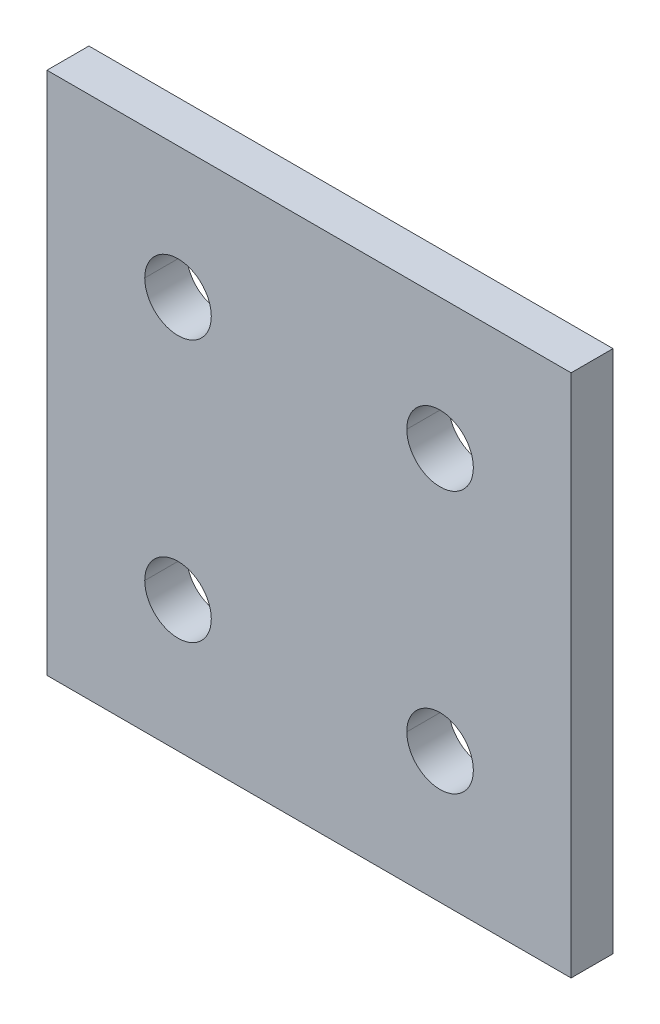
ISO-10303-21;
HEADER;
FILE_DESCRIPTION(('STEP AP214'),'2;1');
FILE_NAME('part.step','',(''),(''),'','','');
FILE_SCHEMA(('AUTOMOTIVE_DESIGN { 1 0 10303 214 1 1 1 1 }'));
ENDSEC;
DATA;
#1=APPLICATION_CONTEXT('core data for automotive mechanical design processes');
#2=APPLICATION_PROTOCOL_DEFINITION('international standard','automotive_design',2000,#1);
#3=PRODUCT_CONTEXT('',#1,'mechanical');
#4=PRODUCT('Part','Part','',(#3));
#5=PRODUCT_RELATED_PRODUCT_CATEGORY('part','',(#4));
#6=PRODUCT_DEFINITION_FORMATION('','',#4);
#7=PRODUCT_DEFINITION_CONTEXT('part definition',#1,'design');
#8=PRODUCT_DEFINITION('design','',#6,#7);
#9=PRODUCT_DEFINITION_SHAPE('','',#8);
#10=(LENGTH_UNIT() NAMED_UNIT(*) SI_UNIT(.MILLI.,.METRE.));
#11=(NAMED_UNIT(*) PLANE_ANGLE_UNIT() SI_UNIT($,.RADIAN.));
#12=(NAMED_UNIT(*) SI_UNIT($,.STERADIAN.) SOLID_ANGLE_UNIT());
#13=UNCERTAINTY_MEASURE_WITH_UNIT(LENGTH_MEASURE(1.E-05),#10,'distance_accuracy_value','');
#14=(GEOMETRIC_REPRESENTATION_CONTEXT(3) GLOBAL_UNCERTAINTY_ASSIGNED_CONTEXT((#13)) GLOBAL_UNIT_ASSIGNED_CONTEXT((#10,
#11,#12)) REPRESENTATION_CONTEXT('',''));
#15=CARTESIAN_POINT('',(0.,0.,0.));
#16=DIRECTION('',(0.,0.,1.));
#17=DIRECTION('',(1.,0.,0.));
#18=AXIS2_PLACEMENT_3D('',#15,#16,#17);
#19=CARTESIAN_POINT('',(25.,50.,4.));
#20=DIRECTION('',(0.,-1.,0.));
#21=DIRECTION('',(0.,0.,-1.));
#22=AXIS2_PLACEMENT_3D('',#19,#20,#21);
#23=PLANE('',#22);
#24=DIRECTION('',(-1.,0.,0.));
#25=VECTOR('',#24,1.);
#26=CARTESIAN_POINT('',(25.,50.,0.));
#27=LINE('',#26,#25);
#28=CARTESIAN_POINT('',(25.,50.,0.));
#29=VERTEX_POINT('',#28);
#30=CARTESIAN_POINT('',(-25.,50.,0.));
#31=VERTEX_POINT('',#30);
#32=EDGE_CURVE('E11',#29,#31,#27,.T.);
#33=ORIENTED_EDGE('',*,*,#32,.T.);
#34=DIRECTION('',(0.,0.,-1.));
#35=VECTOR('',#34,1.);
#36=CARTESIAN_POINT('',(-25.,50.,4.));
#37=LINE('',#36,#35);
#38=CARTESIAN_POINT('',(-25.,50.,4.));
#39=VERTEX_POINT('',#38);
#40=EDGE_CURVE('E24',#39,#31,#37,.T.);
#41=ORIENTED_EDGE('',*,*,#40,.F.);
#42=DIRECTION('',(-1.,0.,0.));
#43=VECTOR('',#42,1.);
#44=CARTESIAN_POINT('',(25.,50.,4.));
#45=LINE('',#44,#43);
#46=CARTESIAN_POINT('',(25.,50.,4.));
#47=VERTEX_POINT('',#46);
#48=EDGE_CURVE('E244',#47,#39,#45,.T.);
#49=ORIENTED_EDGE('',*,*,#48,.F.);
#50=DIRECTION('',(0.,0.,-1.));
#51=VECTOR('',#50,1.);
#52=CARTESIAN_POINT('',(25.,50.,4.));
#53=LINE('',#52,#51);
#54=EDGE_CURVE('E240',#47,#29,#53,.T.);
#55=ORIENTED_EDGE('',*,*,#54,.T.);
#56=EDGE_LOOP('',(#33,#41,#49,#55));
#57=FACE_BOUND('',#56,.T.);
#58=ADVANCED_FACE('F16',(#57),#23,.F.);
#59=CARTESIAN_POINT('',(25.,0.,4.));
#60=DIRECTION('',(-1.,0.,0.));
#61=DIRECTION('',(0.,0.,1.));
#62=AXIS2_PLACEMENT_3D('',#59,#60,#61);
#63=PLANE('',#62);
#64=DIRECTION('',(0.,1.,0.));
#65=VECTOR('',#64,1.);
#66=CARTESIAN_POINT('',(25.,0.,0.));
#67=LINE('',#66,#65);
#68=CARTESIAN_POINT('',(25.,0.,0.));
#69=VERTEX_POINT('',#68);
#70=EDGE_CURVE('E235',#69,#29,#67,.T.);
#71=ORIENTED_EDGE('',*,*,#70,.T.);
#72=ORIENTED_EDGE('',*,*,#54,.F.);
#73=DIRECTION('',(0.,1.,0.));
#74=VECTOR('',#73,1.);
#75=CARTESIAN_POINT('',(25.,0.,4.));
#76=LINE('',#75,#74);
#77=CARTESIAN_POINT('',(25.,0.,4.));
#78=VERTEX_POINT('',#77);
#79=EDGE_CURVE('E230',#78,#47,#76,.T.);
#80=ORIENTED_EDGE('',*,*,#79,.F.);
#81=DIRECTION('',(0.,0.,-1.));
#82=VECTOR('',#81,1.);
#83=CARTESIAN_POINT('',(25.,0.,4.));
#84=LINE('',#83,#82);
#85=EDGE_CURVE('E226',#78,#69,#84,.T.);
#86=ORIENTED_EDGE('',*,*,#85,.T.);
#87=EDGE_LOOP('',(#71,#72,#80,#86));
#88=FACE_BOUND('',#87,.T.);
#89=ADVANCED_FACE('F262',(#88),#63,.F.);
#90=CARTESIAN_POINT('',(-25.,0.,4.));
#91=DIRECTION('',(0.,1.,0.));
#92=DIRECTION('',(0.,0.,1.));
#93=AXIS2_PLACEMENT_3D('',#90,#91,#92);
#94=PLANE('',#93);
#95=DIRECTION('',(1.,0.,0.));
#96=VECTOR('',#95,1.);
#97=CARTESIAN_POINT('',(-25.,0.,0.));
#98=LINE('',#97,#96);
#99=CARTESIAN_POINT('',(-25.,0.,0.));
#100=VERTEX_POINT('',#99);
#101=EDGE_CURVE('E221',#100,#69,#98,.T.);
#102=ORIENTED_EDGE('',*,*,#101,.T.);
#103=ORIENTED_EDGE('',*,*,#85,.F.);
#104=DIRECTION('',(1.,0.,0.));
#105=VECTOR('',#104,1.);
#106=CARTESIAN_POINT('',(-25.,0.,4.));
#107=LINE('',#106,#105);
#108=CARTESIAN_POINT('',(-25.,0.,4.));
#109=VERTEX_POINT('',#108);
#110=EDGE_CURVE('E216',#109,#78,#107,.T.);
#111=ORIENTED_EDGE('',*,*,#110,.F.);
#112=DIRECTION('',(0.,0.,-1.));
#113=VECTOR('',#112,1.);
#114=CARTESIAN_POINT('',(-25.,0.,4.));
#115=LINE('',#114,#113);
#116=EDGE_CURVE('E212',#109,#100,#115,.T.);
#117=ORIENTED_EDGE('',*,*,#116,.T.);
#118=EDGE_LOOP('',(#102,#103,#111,#117));
#119=FACE_BOUND('',#118,.T.);
#120=ADVANCED_FACE('F266',(#119),#94,.F.);
#121=CARTESIAN_POINT('',(-25.,50.,4.));
#122=DIRECTION('',(1.,0.,0.));
#123=DIRECTION('',(0.,0.,-1.));
#124=AXIS2_PLACEMENT_3D('',#121,#122,#123);
#125=PLANE('',#124);
#126=DIRECTION('',(0.,-1.,0.));
#127=VECTOR('',#126,1.);
#128=CARTESIAN_POINT('',(-25.,50.,0.));
#129=LINE('',#128,#127);
#130=EDGE_CURVE('E207',#31,#100,#129,.T.);
#131=ORIENTED_EDGE('',*,*,#130,.T.);
#132=ORIENTED_EDGE('',*,*,#116,.F.);
#133=DIRECTION('',(0.,-1.,0.));
#134=VECTOR('',#133,1.);
#135=CARTESIAN_POINT('',(-25.,50.,4.));
#136=LINE('',#135,#134);
#137=EDGE_CURVE('E202',#39,#109,#136,.T.);
#138=ORIENTED_EDGE('',*,*,#137,.F.);
#139=ORIENTED_EDGE('',*,*,#40,.T.);
#140=EDGE_LOOP('',(#131,#132,#138,#139));
#141=FACE_BOUND('',#140,.T.);
#142=ADVANCED_FACE('F254',(#141),#125,.F.);
#143=CARTESIAN_POINT('',(0.,0.,4.));
#144=DIRECTION('',(0.,0.,1.));
#145=DIRECTION('',(1.,0.,0.));
#146=AXIS2_PLACEMENT_3D('',#143,#144,#145);
#147=PLANE('',#146);
#148=CARTESIAN_POINT('',(-12.5,37.5,4.));
#149=DIRECTION('',(0.,0.,1.));
#150=DIRECTION('',(1.,0.,0.));
#151=AXIS2_PLACEMENT_3D('',#148,#149,#150);
#152=CIRCLE('',#151,3.175);
#153=CARTESIAN_POINT('',(-15.675,37.5,4.));
#154=VERTEX_POINT('',#153);
#155=CARTESIAN_POINT('',(-9.325,37.5,4.));
#156=VERTEX_POINT('',#155);
#157=EDGE_CURVE('E197',#154,#156,#152,.T.);
#158=ORIENTED_EDGE('',*,*,#157,.F.);
#159=CARTESIAN_POINT('',(-12.5,37.5,4.));
#160=DIRECTION('',(0.,0.,1.));
#161=DIRECTION('',(1.,0.,0.));
#162=AXIS2_PLACEMENT_3D('',#159,#160,#161);
#163=CIRCLE('',#162,3.175);
#164=EDGE_CURVE('E192',#156,#154,#163,.T.);
#165=ORIENTED_EDGE('',*,*,#164,.F.);
#166=EDGE_LOOP('',(#158,#165));
#167=FACE_BOUND('',#166,.T.);
#168=CARTESIAN_POINT('',(-12.5,12.5,4.));
#169=DIRECTION('',(0.,0.,1.));
#170=DIRECTION('',(1.,0.,0.));
#171=AXIS2_PLACEMENT_3D('',#168,#169,#170);
#172=CIRCLE('',#171,3.175);
#173=CARTESIAN_POINT('',(-15.675,12.5,4.));
#174=VERTEX_POINT('',#173);
#175=CARTESIAN_POINT('',(-9.325,12.5,4.));
#176=VERTEX_POINT('',#175);
#177=EDGE_CURVE('E187',#174,#176,#172,.T.);
#178=ORIENTED_EDGE('',*,*,#177,.F.);
#179=CARTESIAN_POINT('',(-12.5,12.5,4.));
#180=DIRECTION('',(0.,0.,1.));
#181=DIRECTION('',(1.,0.,0.));
#182=AXIS2_PLACEMENT_3D('',#179,#180,#181);
#183=CIRCLE('',#182,3.175);
#184=EDGE_CURVE('E182',#176,#174,#183,.T.);
#185=ORIENTED_EDGE('',*,*,#184,.F.);
#186=EDGE_LOOP('',(#178,#185));
#187=FACE_BOUND('',#186,.T.);
#188=CARTESIAN_POINT('',(12.5,37.5,4.));
#189=DIRECTION('',(0.,0.,1.));
#190=DIRECTION('',(1.,0.,0.));
#191=AXIS2_PLACEMENT_3D('',#188,#189,#190);
#192=CIRCLE('',#191,3.175);
#193=CARTESIAN_POINT('',(9.325,37.5,4.));
#194=VERTEX_POINT('',#193);
#195=CARTESIAN_POINT('',(15.675,37.5,4.));
#196=VERTEX_POINT('',#195);
#197=EDGE_CURVE('E121',#194,#196,#192,.T.);
#198=ORIENTED_EDGE('',*,*,#197,.F.);
#199=CARTESIAN_POINT('',(12.5,37.5,4.));
#200=DIRECTION('',(0.,0.,1.));
#201=DIRECTION('',(1.,0.,0.));
#202=AXIS2_PLACEMENT_3D('',#199,#200,#201);
#203=CIRCLE('',#202,3.175);
#204=EDGE_CURVE('E175',#196,#194,#203,.T.);
#205=ORIENTED_EDGE('',*,*,#204,.F.);
#206=EDGE_LOOP('',(#198,#205));
#207=FACE_BOUND('',#206,.T.);
#208=CARTESIAN_POINT('',(12.5,12.5,4.));
#209=DIRECTION('',(0.,0.,1.));
#210=DIRECTION('',(1.,0.,0.));
#211=AXIS2_PLACEMENT_3D('',#208,#209,#210);
#212=CIRCLE('',#211,3.175);
#213=CARTESIAN_POINT('',(9.325,12.5,4.));
#214=VERTEX_POINT('',#213);
#215=CARTESIAN_POINT('',(15.675,12.5,4.));
#216=VERTEX_POINT('',#215);
#217=EDGE_CURVE('E170',#214,#216,#212,.T.);
#218=ORIENTED_EDGE('',*,*,#217,.F.);
#219=CARTESIAN_POINT('',(12.5,12.5,4.));
#220=DIRECTION('',(0.,0.,1.));
#221=DIRECTION('',(1.,0.,0.));
#222=AXIS2_PLACEMENT_3D('',#219,#220,#221);
#223=CIRCLE('',#222,3.175);
#224=EDGE_CURVE('E165',#216,#214,#223,.T.);
#225=ORIENTED_EDGE('',*,*,#224,.F.);
#226=EDGE_LOOP('',(#218,#225));
#227=FACE_BOUND('',#226,.T.);
#228=ORIENTED_EDGE('',*,*,#48,.T.);
#229=ORIENTED_EDGE('',*,*,#137,.T.);
#230=ORIENTED_EDGE('',*,*,#110,.T.);
#231=ORIENTED_EDGE('',*,*,#79,.T.);
#232=EDGE_LOOP('',(#228,#229,#230,#231));
#233=FACE_BOUND('',#232,.T.);
#234=ADVANCED_FACE('F258',(#167,#187,#207,#227,#233),#147,.T.);
#235=CARTESIAN_POINT('',(12.5,12.5,4.));
#236=DIRECTION('',(0.,0.,-1.));
#237=DIRECTION('',(0.,-1.,0.));
#238=AXIS2_PLACEMENT_3D('',#235,#236,#237);
#239=CYLINDRICAL_SURFACE('',#238,3.175);
#240=DIRECTION('',(0.,0.,-1.));
#241=VECTOR('',#240,1.);
#242=CARTESIAN_POINT('',(15.675,12.5,4.));
#243=LINE('',#242,#241);
#244=CARTESIAN_POINT('',(15.675,12.5,0.));
#245=VERTEX_POINT('',#244);
#246=EDGE_CURVE('E160',#216,#245,#243,.T.);
#247=ORIENTED_EDGE('',*,*,#246,.F.);
#248=ORIENTED_EDGE('',*,*,#224,.T.);
#249=DIRECTION('',(0.,0.,-1.));
#250=VECTOR('',#249,1.);
#251=CARTESIAN_POINT('',(9.325,12.5,4.));
#252=LINE('',#251,#250);
#253=CARTESIAN_POINT('',(9.325,12.5,0.));
#254=VERTEX_POINT('',#253);
#255=EDGE_CURVE('E156',#214,#254,#252,.T.);
#256=ORIENTED_EDGE('',*,*,#255,.T.);
#257=CARTESIAN_POINT('',(12.5,12.5,0.));
#258=DIRECTION('',(0.,0.,1.));
#259=DIRECTION('',(1.,0.,0.));
#260=AXIS2_PLACEMENT_3D('',#257,#258,#259);
#261=CIRCLE('',#260,3.175);
#262=EDGE_CURVE('E151',#245,#254,#261,.T.);
#263=ORIENTED_EDGE('',*,*,#262,.F.);
#264=EDGE_LOOP('',(#247,#248,#256,#263));
#265=FACE_BOUND('',#264,.T.);
#266=ADVANCED_FACE('F310',(#265),#239,.F.);
#267=CARTESIAN_POINT('',(0.,0.,0.));
#268=DIRECTION('',(0.,0.,1.));
#269=DIRECTION('',(1.,0.,0.));
#270=AXIS2_PLACEMENT_3D('',#267,#268,#269);
#271=PLANE('',#270);
#272=CARTESIAN_POINT('',(-12.5,37.5,0.));
#273=DIRECTION('',(0.,0.,1.));
#274=DIRECTION('',(1.,0.,0.));
#275=AXIS2_PLACEMENT_3D('',#272,#273,#274);
#276=CIRCLE('',#275,3.175);
#277=CARTESIAN_POINT('',(-9.325,37.5,0.));
#278=VERTEX_POINT('',#277);
#279=CARTESIAN_POINT('',(-15.675,37.5,0.));
#280=VERTEX_POINT('',#279);
#281=EDGE_CURVE('E147',#278,#280,#276,.T.);
#282=ORIENTED_EDGE('',*,*,#281,.T.);
#283=CARTESIAN_POINT('',(-12.5,37.5,0.));
#284=DIRECTION('',(0.,0.,1.));
#285=DIRECTION('',(1.,0.,0.));
#286=AXIS2_PLACEMENT_3D('',#283,#284,#285);
#287=CIRCLE('',#286,3.175);
#288=EDGE_CURVE('E143',#280,#278,#287,.T.);
#289=ORIENTED_EDGE('',*,*,#288,.T.);
#290=EDGE_LOOP('',(#282,#289));
#291=FACE_BOUND('',#290,.T.);
#292=CARTESIAN_POINT('',(-12.5,12.5,0.));
#293=DIRECTION('',(0.,0.,1.));
#294=DIRECTION('',(1.,0.,0.));
#295=AXIS2_PLACEMENT_3D('',#292,#293,#294);
#296=CIRCLE('',#295,3.175);
#297=CARTESIAN_POINT('',(-9.325,12.5,0.));
#298=VERTEX_POINT('',#297);
#299=CARTESIAN_POINT('',(-15.675,12.5,0.));
#300=VERTEX_POINT('',#299);
#301=EDGE_CURVE('E139',#298,#300,#296,.T.);
#302=ORIENTED_EDGE('',*,*,#301,.T.);
#303=CARTESIAN_POINT('',(-12.5,12.5,0.));
#304=DIRECTION('',(0.,0.,1.));
#305=DIRECTION('',(1.,0.,0.));
#306=AXIS2_PLACEMENT_3D('',#303,#304,#305);
#307=CIRCLE('',#306,3.175);
#308=EDGE_CURVE('E118',#300,#298,#307,.T.);
#309=ORIENTED_EDGE('',*,*,#308,.T.);
#310=EDGE_LOOP('',(#302,#309));
#311=FACE_BOUND('',#310,.T.);
#312=CARTESIAN_POINT('',(12.5,37.5,0.));
#313=DIRECTION('',(0.,0.,1.));
#314=DIRECTION('',(1.,0.,0.));
#315=AXIS2_PLACEMENT_3D('',#312,#313,#314);
#316=CIRCLE('',#315,3.175);
#317=CARTESIAN_POINT('',(15.675,37.5,0.));
#318=VERTEX_POINT('',#317);
#319=CARTESIAN_POINT('',(9.325,37.5,0.));
#320=VERTEX_POINT('',#319);
#321=EDGE_CURVE('E104',#318,#320,#316,.T.);
#322=ORIENTED_EDGE('',*,*,#321,.T.);
#323=CARTESIAN_POINT('',(12.5,37.5,0.));
#324=DIRECTION('',(0.,0.,1.));
#325=DIRECTION('',(1.,0.,0.));
#326=AXIS2_PLACEMENT_3D('',#323,#324,#325);
#327=CIRCLE('',#326,3.175);
#328=EDGE_CURVE('E100',#320,#318,#327,.T.);
#329=ORIENTED_EDGE('',*,*,#328,.T.);
#330=EDGE_LOOP('',(#322,#329));
#331=FACE_BOUND('',#330,.T.);
#332=ORIENTED_EDGE('',*,*,#262,.T.);
#333=CARTESIAN_POINT('',(12.5,12.5,0.));
#334=DIRECTION('',(0.,0.,1.));
#335=DIRECTION('',(1.,0.,0.));
#336=AXIS2_PLACEMENT_3D('',#333,#334,#335);
#337=CIRCLE('',#336,3.175);
#338=EDGE_CURVE('E109',#254,#245,#337,.T.);
#339=ORIENTED_EDGE('',*,*,#338,.T.);
#340=EDGE_LOOP('',(#332,#339));
#341=FACE_BOUND('',#340,.T.);
#342=ORIENTED_EDGE('',*,*,#32,.F.);
#343=ORIENTED_EDGE('',*,*,#70,.F.);
#344=ORIENTED_EDGE('',*,*,#101,.F.);
#345=ORIENTED_EDGE('',*,*,#130,.F.);
#346=EDGE_LOOP('',(#342,#343,#344,#345));
#347=FACE_BOUND('',#346,.T.);
#348=ADVANCED_FACE('F102',(#291,#311,#331,#341,#347),#271,.F.);
#349=CARTESIAN_POINT('',(12.5,12.5,4.));
#350=DIRECTION('',(0.,0.,-1.));
#351=DIRECTION('',(0.,1.,0.));
#352=AXIS2_PLACEMENT_3D('',#349,#350,#351);
#353=CYLINDRICAL_SURFACE('',#352,3.175);
#354=ORIENTED_EDGE('',*,*,#246,.T.);
#355=ORIENTED_EDGE('',*,*,#338,.F.);
#356=ORIENTED_EDGE('',*,*,#255,.F.);
#357=ORIENTED_EDGE('',*,*,#217,.T.);
#358=EDGE_LOOP('',(#354,#355,#356,#357));
#359=FACE_BOUND('',#358,.T.);
#360=ADVANCED_FACE('F331',(#359),#353,.F.);
#361=CARTESIAN_POINT('',(12.5,37.5,4.));
#362=DIRECTION('',(0.,0.,-1.));
#363=DIRECTION('',(0.,1.,0.));
#364=AXIS2_PLACEMENT_3D('',#361,#362,#363);
#365=CYLINDRICAL_SURFACE('',#364,3.175);
#366=DIRECTION('',(0.,0.,-1.));
#367=VECTOR('',#366,1.);
#368=CARTESIAN_POINT('',(15.675,37.5,4.));
#369=LINE('',#368,#367);
#370=EDGE_CURVE('E115',#196,#318,#369,.T.);
#371=ORIENTED_EDGE('',*,*,#370,.T.);
#372=ORIENTED_EDGE('',*,*,#328,.F.);
#373=DIRECTION('',(0.,0.,-1.));
#374=VECTOR('',#373,1.);
#375=CARTESIAN_POINT('',(9.325,37.5,4.));
#376=LINE('',#375,#374);
#377=EDGE_CURVE('E117',#194,#320,#376,.T.);
#378=ORIENTED_EDGE('',*,*,#377,.F.);
#379=ORIENTED_EDGE('',*,*,#197,.T.);
#380=EDGE_LOOP('',(#371,#372,#378,#379));
#381=FACE_BOUND('',#380,.T.);
#382=ADVANCED_FACE('F120',(#381),#365,.F.);
#383=CARTESIAN_POINT('',(12.5,37.5,4.));
#384=DIRECTION('',(0.,0.,-1.));
#385=DIRECTION('',(0.,-1.,0.));
#386=AXIS2_PLACEMENT_3D('',#383,#384,#385);
#387=CYLINDRICAL_SURFACE('',#386,3.175);
#388=ORIENTED_EDGE('',*,*,#370,.F.);
#389=ORIENTED_EDGE('',*,*,#204,.T.);
#390=ORIENTED_EDGE('',*,*,#377,.T.);
#391=ORIENTED_EDGE('',*,*,#321,.F.);
#392=EDGE_LOOP('',(#388,#389,#390,#391));
#393=FACE_BOUND('',#392,.T.);
#394=ADVANCED_FACE('F113',(#393),#387,.F.);
#395=CARTESIAN_POINT('',(-12.5,12.5,4.));
#396=DIRECTION('',(0.,0.,-1.));
#397=DIRECTION('',(0.,1.,0.));
#398=AXIS2_PLACEMENT_3D('',#395,#396,#397);
#399=CYLINDRICAL_SURFACE('',#398,3.175);
#400=DIRECTION('',(0.,0.,-1.));
#401=VECTOR('',#400,1.);
#402=CARTESIAN_POINT('',(-9.325,12.5,4.));
#403=LINE('',#402,#401);
#404=EDGE_CURVE('E125',#176,#298,#403,.T.);
#405=ORIENTED_EDGE('',*,*,#404,.T.);
#406=ORIENTED_EDGE('',*,*,#308,.F.);
#407=DIRECTION('',(0.,0.,-1.));
#408=VECTOR('',#407,1.);
#409=CARTESIAN_POINT('',(-15.675,12.5,4.));
#410=LINE('',#409,#408);
#411=EDGE_CURVE('E436',#174,#300,#410,.T.);
#412=ORIENTED_EDGE('',*,*,#411,.F.);
#413=ORIENTED_EDGE('',*,*,#177,.T.);
#414=EDGE_LOOP('',(#405,#406,#412,#413));
#415=FACE_BOUND('',#414,.T.);
#416=ADVANCED_FACE('F361',(#415),#399,.F.);
#417=CARTESIAN_POINT('',(-12.5,12.5,4.));
#418=DIRECTION('',(0.,0.,-1.));
#419=DIRECTION('',(0.,-1.,0.));
#420=AXIS2_PLACEMENT_3D('',#417,#418,#419);
#421=CYLINDRICAL_SURFACE('',#420,3.175);
#422=ORIENTED_EDGE('',*,*,#404,.F.);
#423=ORIENTED_EDGE('',*,*,#184,.T.);
#424=ORIENTED_EDGE('',*,*,#411,.T.);
#425=ORIENTED_EDGE('',*,*,#301,.F.);
#426=EDGE_LOOP('',(#422,#423,#424,#425));
#427=FACE_BOUND('',#426,.T.);
#428=ADVANCED_FACE('F371',(#427),#421,.F.);
#429=CARTESIAN_POINT('',(-12.5,37.5,4.));
#430=DIRECTION('',(0.,0.,-1.));
#431=DIRECTION('',(0.,1.,0.));
#432=AXIS2_PLACEMENT_3D('',#429,#430,#431);
#433=CYLINDRICAL_SURFACE('',#432,3.175);
#434=DIRECTION('',(0.,0.,-1.));
#435=VECTOR('',#434,1.);
#436=CARTESIAN_POINT('',(-9.325,37.5,4.));
#437=LINE('',#436,#435);
#438=EDGE_CURVE('E433',#156,#278,#437,.T.);
#439=ORIENTED_EDGE('',*,*,#438,.T.);
#440=ORIENTED_EDGE('',*,*,#288,.F.);
#441=DIRECTION('',(0.,0.,-1.));
#442=VECTOR('',#441,1.);
#443=CARTESIAN_POINT('',(-15.675,37.5,4.));
#444=LINE('',#443,#442);
#445=EDGE_CURVE('E437',#154,#280,#444,.T.);
#446=ORIENTED_EDGE('',*,*,#445,.F.);
#447=ORIENTED_EDGE('',*,*,#157,.T.);
#448=EDGE_LOOP('',(#439,#440,#446,#447));
#449=FACE_BOUND('',#448,.T.);
#450=ADVANCED_FACE('F382',(#449),#433,.F.);
#451=CARTESIAN_POINT('',(-12.5,37.5,4.));
#452=DIRECTION('',(0.,0.,-1.));
#453=DIRECTION('',(0.,-1.,0.));
#454=AXIS2_PLACEMENT_3D('',#451,#452,#453);
#455=CYLINDRICAL_SURFACE('',#454,3.175);
#456=ORIENTED_EDGE('',*,*,#438,.F.);
#457=ORIENTED_EDGE('',*,*,#164,.T.);
#458=ORIENTED_EDGE('',*,*,#445,.T.);
#459=ORIENTED_EDGE('',*,*,#281,.F.);
#460=EDGE_LOOP('',(#456,#457,#458,#459));
#461=FACE_BOUND('',#460,.T.);
#462=ADVANCED_FACE('F393',(#461),#455,.F.);
#463=CLOSED_SHELL('',(#58,#89,#120,#142,#234,#266,#348,#360,#382,#394,#416,#428,#450,#462));
#464=MANIFOLD_SOLID_BREP('B1',#463);
#465=ADVANCED_BREP_SHAPE_REPRESENTATION('',(#18,#464),#14);
#466=SHAPE_DEFINITION_REPRESENTATION(#9,#465);
ENDSEC;
END-ISO-10303-21;
